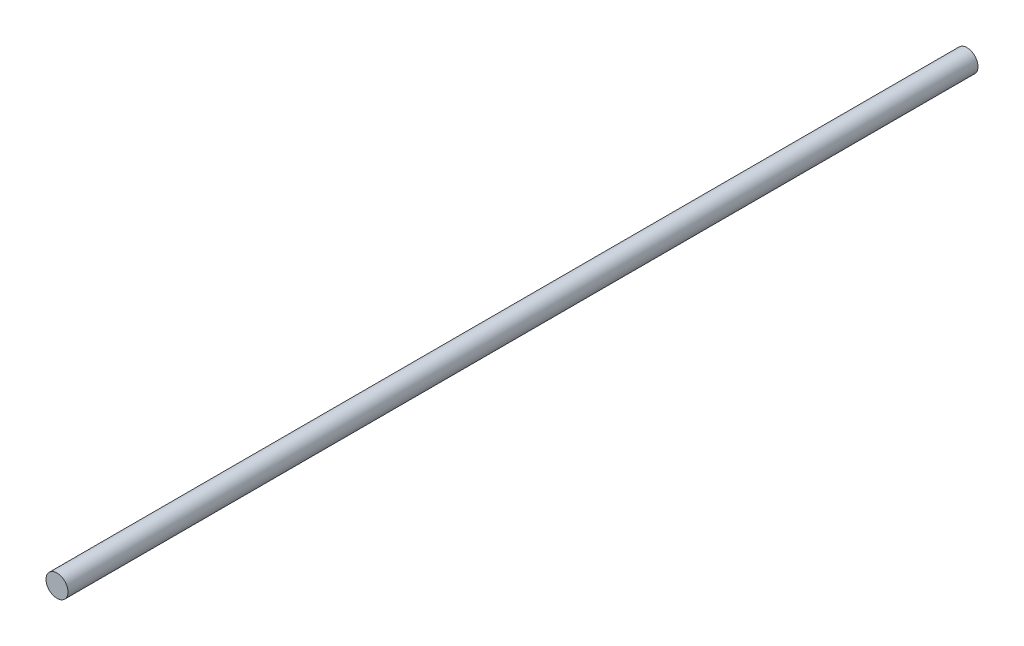
ISO-10303-21;
HEADER;
FILE_DESCRIPTION(('STEP AP214'),'2;1');
FILE_NAME('part.step','',(''),(''),'','','');
FILE_SCHEMA(('AUTOMOTIVE_DESIGN { 1 0 10303 214 1 1 1 1 }'));
ENDSEC;
DATA;
#1=APPLICATION_CONTEXT('core data for automotive mechanical design processes');
#2=APPLICATION_PROTOCOL_DEFINITION('international standard','automotive_design',2000,#1);
#3=PRODUCT_CONTEXT('',#1,'mechanical');
#4=PRODUCT('Part','Part','',(#3));
#5=PRODUCT_RELATED_PRODUCT_CATEGORY('part','',(#4));
#6=PRODUCT_DEFINITION_FORMATION('','',#4);
#7=PRODUCT_DEFINITION_CONTEXT('part definition',#1,'design');
#8=PRODUCT_DEFINITION('design','',#6,#7);
#9=PRODUCT_DEFINITION_SHAPE('','',#8);
#10=(LENGTH_UNIT() NAMED_UNIT(*) SI_UNIT(.MILLI.,.METRE.));
#11=(NAMED_UNIT(*) PLANE_ANGLE_UNIT() SI_UNIT($,.RADIAN.));
#12=(NAMED_UNIT(*) SI_UNIT($,.STERADIAN.) SOLID_ANGLE_UNIT());
#13=UNCERTAINTY_MEASURE_WITH_UNIT(LENGTH_MEASURE(1.E-05),#10,'distance_accuracy_value','');
#14=(GEOMETRIC_REPRESENTATION_CONTEXT(3) GLOBAL_UNCERTAINTY_ASSIGNED_CONTEXT((#13)) GLOBAL_UNIT_ASSIGNED_CONTEXT((#10,
#11,#12)) REPRESENTATION_CONTEXT('',''));
#15=CARTESIAN_POINT('',(0.,0.,0.));
#16=DIRECTION('',(0.,0.,1.));
#17=DIRECTION('',(1.,0.,0.));
#18=AXIS2_PLACEMENT_3D('',#15,#16,#17);
#19=CARTESIAN_POINT('',(0.,0.,331.));
#20=DIRECTION('',(0.,0.,-1.));
#21=DIRECTION('',(-1.,0.,0.));
#22=AXIS2_PLACEMENT_3D('',#19,#20,#21);
#23=CYLINDRICAL_SURFACE('',#22,4.);
#24=CARTESIAN_POINT('',(0.,0.,331.));
#25=DIRECTION('',(0.,0.,1.));
#26=DIRECTION('',(1.,0.,0.));
#27=AXIS2_PLACEMENT_3D('',#24,#25,#26);
#28=CIRCLE('',#27,4.);
#29=CARTESIAN_POINT('',(4.,0.,331.));
#30=VERTEX_POINT('',#29);
#31=EDGE_CURVE('E10',#30,#30,#28,.T.);
#32=ORIENTED_EDGE('',*,*,#31,.F.);
#33=EDGE_LOOP('',(#32));
#34=FACE_BOUND('',#33,.T.);
#35=CARTESIAN_POINT('',(0.,0.,0.));
#36=DIRECTION('',(0.,0.,1.));
#37=DIRECTION('',(1.,0.,0.));
#38=AXIS2_PLACEMENT_3D('',#35,#36,#37);
#39=CIRCLE('',#38,4.);
#40=CARTESIAN_POINT('',(4.,0.,0.));
#41=VERTEX_POINT('',#40);
#42=EDGE_CURVE('E36',#41,#41,#39,.T.);
#43=ORIENTED_EDGE('',*,*,#42,.T.);
#44=EDGE_LOOP('',(#43));
#45=FACE_BOUND('',#44,.T.);
#46=ADVANCED_FACE('F33',(#34,#45),#23,.T.);
#47=CARTESIAN_POINT('',(0.,0.,331.));
#48=DIRECTION('',(0.,0.,1.));
#49=DIRECTION('',(1.,0.,0.));
#50=AXIS2_PLACEMENT_3D('',#47,#48,#49);
#51=PLANE('',#50);
#52=ORIENTED_EDGE('',*,*,#31,.T.);
#53=EDGE_LOOP('',(#52));
#54=FACE_BOUND('',#53,.T.);
#55=ADVANCED_FACE('F48',(#54),#51,.T.);
#56=CARTESIAN_POINT('',(0.,0.,0.));
#57=DIRECTION('',(0.,0.,1.));
#58=DIRECTION('',(1.,0.,0.));
#59=AXIS2_PLACEMENT_3D('',#56,#57,#58);
#60=PLANE('',#59);
#61=ORIENTED_EDGE('',*,*,#42,.F.);
#62=EDGE_LOOP('',(#61));
#63=FACE_BOUND('',#62,.T.);
#64=ADVANCED_FACE('F46',(#63),#60,.F.);
#65=CLOSED_SHELL('',(#46,#55,#64));
#66=MANIFOLD_SOLID_BREP('B2',#65);
#67=ADVANCED_BREP_SHAPE_REPRESENTATION('',(#18,#66),#14);
#68=SHAPE_DEFINITION_REPRESENTATION(#9,#67);
ENDSEC;
END-ISO-10303-21;
